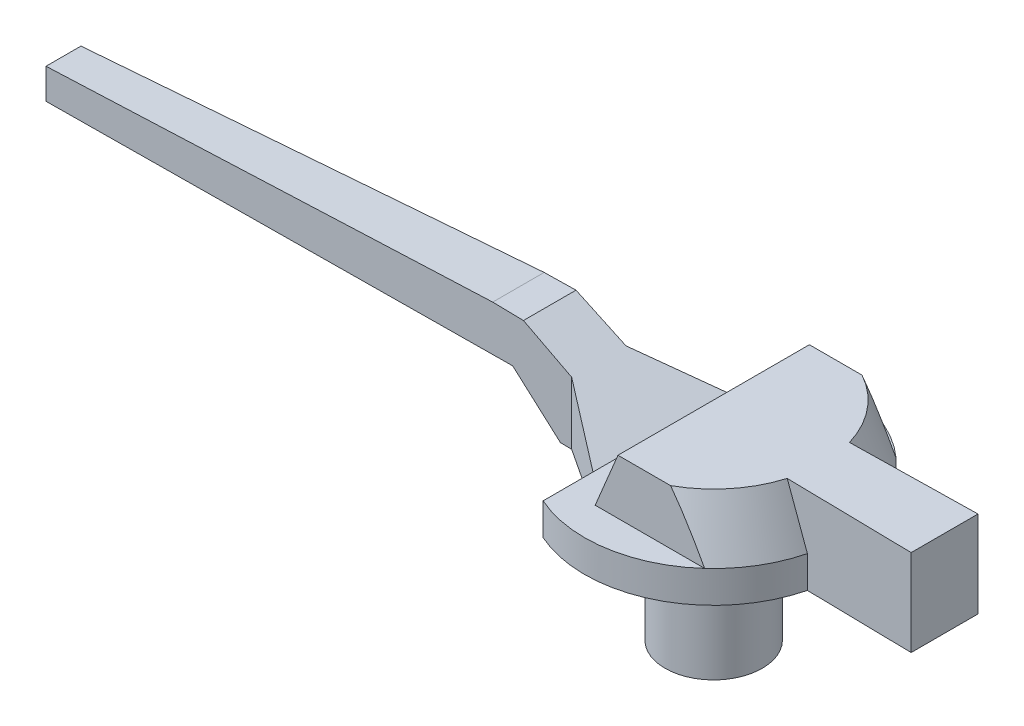
ISO-10303-21;
HEADER;
FILE_DESCRIPTION(('STEP AP214'),'2;1');
FILE_NAME('part.step','',(''),(''),'','','');
FILE_SCHEMA(('AUTOMOTIVE_DESIGN { 1 0 10303 214 1 1 1 1 }'));
ENDSEC;
DATA;
#1=APPLICATION_CONTEXT('core data for automotive mechanical design processes');
#2=APPLICATION_PROTOCOL_DEFINITION('international standard','automotive_design',2000,#1);
#3=PRODUCT_CONTEXT('',#1,'mechanical');
#4=PRODUCT('Part','Part','',(#3));
#5=PRODUCT_RELATED_PRODUCT_CATEGORY('part','',(#4));
#6=PRODUCT_DEFINITION_FORMATION('','',#4);
#7=PRODUCT_DEFINITION_CONTEXT('part definition',#1,'design');
#8=PRODUCT_DEFINITION('design','',#6,#7);
#9=PRODUCT_DEFINITION_SHAPE('','',#8);
#10=(LENGTH_UNIT() NAMED_UNIT(*) SI_UNIT(.MILLI.,.METRE.));
#11=(NAMED_UNIT(*) PLANE_ANGLE_UNIT() SI_UNIT($,.RADIAN.));
#12=(NAMED_UNIT(*) SI_UNIT($,.STERADIAN.) SOLID_ANGLE_UNIT());
#13=UNCERTAINTY_MEASURE_WITH_UNIT(LENGTH_MEASURE(1.E-05),#10,'distance_accuracy_value','');
#14=(GEOMETRIC_REPRESENTATION_CONTEXT(3) GLOBAL_UNCERTAINTY_ASSIGNED_CONTEXT((#13)) GLOBAL_UNIT_ASSIGNED_CONTEXT((#10,
#11,#12)) REPRESENTATION_CONTEXT('',''));
#15=CARTESIAN_POINT('',(0.,0.,0.));
#16=DIRECTION('',(0.,0.,1.));
#17=DIRECTION('',(1.,0.,0.));
#18=AXIS2_PLACEMENT_3D('',#15,#16,#17);
#19=CARTESIAN_POINT('',(0.,6.85,3.59485357832084));
#20=DIRECTION('',(0.,1.,0.));
#21=DIRECTION('',(0.,0.,1.));
#22=AXIS2_PLACEMENT_3D('',#19,#20,#21);
#23=PLANE('',#22);
#24=DIRECTION('',(0.,0.,1.));
#25=VECTOR('',#24,1.);
#26=CARTESIAN_POINT('',(0.,6.85,-4.25));
#27=LINE('',#26,#25);
#28=CARTESIAN_POINT('',(0.,6.85,-3.15));
#29=VERTEX_POINT('',#28);
#30=CARTESIAN_POINT('',(0.,6.85,3.15));
#31=VERTEX_POINT('',#30);
#32=EDGE_CURVE('E231',#29,#31,#27,.T.);
#33=ORIENTED_EDGE('',*,*,#32,.T.);
#34=DIRECTION('',(1.,0.,0.));
#35=VECTOR('',#34,1.);
#36=CARTESIAN_POINT('',(-22.7341210153043,6.85,3.15));
#37=LINE('',#36,#35);
#38=CARTESIAN_POINT('',(1.73218712891134,6.85,3.15));
#39=VERTEX_POINT('',#38);
#40=EDGE_CURVE('E258',#31,#39,#37,.T.);
#41=ORIENTED_EDGE('',*,*,#40,.T.);
#42=CARTESIAN_POINT('',(0.,6.85,0.));
#43=DIRECTION('',(0.,1.,0.));
#44=DIRECTION('',(0.,0.,1.));
#45=AXIS2_PLACEMENT_3D('',#42,#43,#44);
#46=CIRCLE('',#45,3.59485357832084);
#47=CARTESIAN_POINT('',(3.44568894200541,6.85,1.02479264463975));
#48=VERTEX_POINT('',#47);
#49=EDGE_CURVE('E346',#39,#48,#46,.T.);
#50=ORIENTED_EDGE('',*,*,#49,.T.);
#51=DIRECTION('',(0.999836172848061,0.,0.0181004824394906));
#52=VECTOR('',#51,1.);
#53=CARTESIAN_POINT('',(-21.4,6.85,0.575000000000003));
#54=LINE('',#53,#52);
#55=CARTESIAN_POINT('',(7.6,6.85,1.1));
#56=VERTEX_POINT('',#55);
#57=EDGE_CURVE('E435',#48,#56,#54,.T.);
#58=ORIENTED_EDGE('',*,*,#57,.T.);
#59=DIRECTION('',(0.,0.,-1.));
#60=VECTOR('',#59,1.);
#61=CARTESIAN_POINT('',(7.6,6.85,-1.1));
#62=LINE('',#61,#60);
#63=CARTESIAN_POINT('',(7.6,6.85,-1.1));
#64=VERTEX_POINT('',#63);
#65=EDGE_CURVE('E276',#56,#64,#62,.T.);
#66=ORIENTED_EDGE('',*,*,#65,.T.);
#67=DIRECTION('',(-0.999836172848061,0.,0.0181004824394909));
#68=VECTOR('',#67,1.);
#69=CARTESIAN_POINT('',(-21.4,6.85,-0.574999999999997));
#70=LINE('',#69,#68);
#71=CARTESIAN_POINT('',(3.44568894200541,6.85,-1.02479264463975));
#72=VERTEX_POINT('',#71);
#73=EDGE_CURVE('E358',#64,#72,#70,.T.);
#74=ORIENTED_EDGE('',*,*,#73,.T.);
#75=CARTESIAN_POINT('',(1.73218712891134,6.85,-3.15));
#76=VERTEX_POINT('',#75);
#77=EDGE_CURVE('E347',#72,#76,#46,.T.);
#78=ORIENTED_EDGE('',*,*,#77,.T.);
#79=DIRECTION('',(-1.,0.,0.));
#80=VECTOR('',#79,1.);
#81=CARTESIAN_POINT('',(-22.7341210153043,6.85,-3.15));
#82=LINE('',#81,#80);
#83=EDGE_CURVE('E253',#76,#29,#82,.T.);
#84=ORIENTED_EDGE('',*,*,#83,.T.);
#85=EDGE_LOOP('',(#33,#41,#50,#58,#66,#74,#78,#84));
#86=FACE_BOUND('',#85,.T.);
#87=ADVANCED_FACE('F35',(#86),#23,.T.);
#88=CARTESIAN_POINT('',(-22.7341210153043,5.05,-3.15));
#89=DIRECTION('',(0.,0.,-1.));
#90=DIRECTION('',(-1.,0.,0.));
#91=AXIS2_PLACEMENT_3D('',#88,#89,#90);
#92=PLANE('',#91);
#93=DIRECTION('',(-0.384309346161683,-0.92320437956759,0.));
#94=VECTOR('',#93,1.);
#95=CARTESIAN_POINT('',(-3.99631877629076,-2.75012821251461,-3.15));
#96=LINE('',#95,#94);
#97=CARTESIAN_POINT('',(-0.749299763303804,5.05,-3.15));
#98=VERTEX_POINT('',#97);
#99=EDGE_CURVE('E246',#29,#98,#96,.T.);
#100=ORIENTED_EDGE('',*,*,#99,.F.);
#101=ORIENTED_EDGE('',*,*,#83,.F.);
#102=CARTESIAN_POINT('',(5.22381936480329,-0.033010855341316,-3.15));
#103=CARTESIAN_POINT('',(5.14495567701918,0.152532557431077,-3.15));
#104=CARTESIAN_POINT('',(5.06569488382415,0.337907468383486,-3.15));
#105=CARTESIAN_POINT('',(4.90624962533424,0.708263200551652,-3.15));
#106=CARTESIAN_POINT('',(4.82606514450563,0.893244015077681,-3.15));
#107=CARTESIAN_POINT('',(4.5838649730113,1.44766284120869,-3.15));
#108=CARTESIAN_POINT('',(4.42027170529409,1.81641390338952,-3.15));
#109=CARTESIAN_POINT('',(4.08649805080444,2.55342080769807,-3.15));
#110=CARTESIAN_POINT('',(3.9162860135979,2.92166241651889,-3.15));
#111=CARTESIAN_POINT('',(3.65487510984843,3.47109020263562,-3.15));
#112=CARTESIAN_POINT('',(3.56673013433733,3.6537288583614,-3.15));
#113=CARTESIAN_POINT('',(3.38794802768471,4.017780370278,-3.15));
#114=CARTESIAN_POINT('',(3.2973109675942,4.19919326123285,-3.15));
#115=CARTESIAN_POINT('',(3.1429377038914,4.50168901154047,-3.15));
#116=CARTESIAN_POINT('',(3.08004165800818,4.62320048948627,-3.15));
#117=CARTESIAN_POINT('',(2.95260227884569,4.8653618981108,-3.15));
#118=CARTESIAN_POINT('',(2.8880589071674,4.98601180862241,-3.15));
#119=CARTESIAN_POINT('',(2.75713158951244,5.22606722716639,-3.15));
#120=CARTESIAN_POINT('',(2.69075067362047,5.34547438358233,-3.15));
#121=CARTESIAN_POINT('',(2.55567102168519,5.58296741215928,-3.15));
#122=CARTESIAN_POINT('',(2.48697236945122,5.70105333189103,-3.15));
#123=CARTESIAN_POINT('',(2.31496424942398,5.98874752581349,-3.15));
#124=CARTESIAN_POINT('',(2.21009154129165,6.15742725512448,-3.15));
#125=CARTESIAN_POINT('',(1.99196048385707,6.49004452262692,-3.15));
#126=CARTESIAN_POINT('',(1.87867998533311,6.65396782991419,-3.15));
#127=CARTESIAN_POINT('',(1.69739520071601,6.89681947482825,-3.15));
#128=CARTESIAN_POINT('',(1.63364150534616,6.97891035771082,-3.15));
#129=CARTESIAN_POINT('',(1.50212944766067,7.13992868366571,-3.15));
#130=CARTESIAN_POINT('',(1.43436884485295,7.21885431467363,-3.15));
#131=CARTESIAN_POINT('',(1.29419687235199,7.3719014141089,-3.15));
#132=CARTESIAN_POINT('',(1.22180613172348,7.44604158882279,-3.15));
#133=CARTESIAN_POINT('',(1.07095134448111,7.58778836033345,-3.15));
#134=CARTESIAN_POINT('',(0.992496222236826,7.65540424061663,-3.15));
#135=CARTESIAN_POINT('',(0.845782642582632,7.76729629194008,-3.15));
#136=CARTESIAN_POINT('',(0.778983405493767,7.81345883202385,-3.15));
#137=CARTESIAN_POINT('',(0.640117072602644,7.89729802373699,-3.15));
#138=CARTESIAN_POINT('',(0.568049216947703,7.93497344812378,-3.15));
#139=CARTESIAN_POINT('',(0.417549587897641,7.99893892729097,-3.15));
#140=CARTESIAN_POINT('',(0.33903796604973,8.02504791739727,-3.15));
#141=CARTESIAN_POINT('',(0.178432781640517,8.0611110724464,-3.15));
#142=CARTESIAN_POINT('',(0.096349961707025,8.07111065476694,-3.15));
#143=CARTESIAN_POINT('',(-0.0573582576975756,8.0730314333221,-3.15));
#144=CARTESIAN_POINT('',(-0.128961958287773,8.0671252034297,-3.15));
#145=CARTESIAN_POINT('',(-0.269995681888301,8.04265285116534,-3.15));
#146=CARTESIAN_POINT('',(-0.339422302947616,8.02406785640181,-3.15));
#147=CARTESIAN_POINT('',(-0.497035075839306,7.96859490489518,-3.15));
#148=CARTESIAN_POINT('',(-0.583769931304419,7.9276730256982,-3.15));
#149=CARTESIAN_POINT('',(-0.749963771207834,7.83314471384848,-3.15));
#150=CARTESIAN_POINT('',(-0.829403714269844,7.77950632468678,-3.15));
#151=CARTESIAN_POINT('',(-1.00180937817989,7.64863871243276,-3.15));
#152=CARTESIAN_POINT('',(-1.09284507954546,7.56891399257645,-3.15));
#153=CARTESIAN_POINT('',(-1.26696061828916,7.40110679303775,-3.15));
#154=CARTESIAN_POINT('',(-1.35002391421322,7.3130076602965,-3.15));
#155=CARTESIAN_POINT('',(-1.51044587634024,7.13080847705093,-3.15));
#156=CARTESIAN_POINT('',(-1.58776451023087,7.03667354255814,-3.15));
#157=CARTESIAN_POINT('',(-1.7000233279777,6.89269216163978,-3.15));
#158=CARTESIAN_POINT('',(-1.73680673483998,6.84425851733016,-3.15));
#159=CARTESIAN_POINT('',(-1.80928449234865,6.7465839411893,-3.15));
#160=CARTESIAN_POINT('',(-1.84497887400011,6.69734303240275,-3.15));
#161=CARTESIAN_POINT('',(-1.95702732044978,6.53956731775937,-3.15));
#162=CARTESIAN_POINT('',(-2.03156983116559,6.42974516138425,-3.15));
#163=CARTESIAN_POINT('',(-2.17703999359645,6.20772350136295,-3.15));
#164=CARTESIAN_POINT('',(-2.24796695394313,6.09552354879672,-3.15));
#165=CARTESIAN_POINT('',(-2.3869353428927,5.8692621596948,-3.15));
#166=CARTESIAN_POINT('',(-2.45497499342075,5.7551996343321,-3.15));
#167=CARTESIAN_POINT('',(-2.58864585682077,5.52566901348548,-3.15));
#168=CARTESIAN_POINT('',(-2.654276933036,5.41020083874185,-3.15));
#169=CARTESIAN_POINT('',(-2.8484884143847,5.06157369410575,-3.15));
#170=CARTESIAN_POINT('',(-2.97405784074283,4.82673804062048,-3.15));
#171=CARTESIAN_POINT('',(-3.21938233758963,4.35418241089293,-3.15));
#172=CARTESIAN_POINT('',(-3.33913941554113,4.11646346644813,-3.15));
#173=CARTESIAN_POINT('',(-3.57424196074227,3.63902282157942,-3.15));
#174=CARTESIAN_POINT('',(-3.68958982645136,3.39930229897353,-3.15));
#175=CARTESIAN_POINT('',(-3.91692895759912,2.91825595307042,-3.15));
#176=CARTESIAN_POINT('',(-4.02891994242668,2.67692999761955,-3.15));
#177=CARTESIAN_POINT('',(-4.25009536736851,2.19334151251332,-3.15));
#178=CARTESIAN_POINT('',(-4.35928295768747,1.95108042073242,-3.15));
#179=CARTESIAN_POINT('',(-4.57549427132912,1.4655943198773,-3.15));
#180=CARTESIAN_POINT('',(-4.68251798190039,1.22236930513293,-3.15));
#181=CARTESIAN_POINT('',(-4.86201325734104,0.810357735188615,-3.15));
#182=CARTESIAN_POINT('',(-4.93495074047685,0.641773760137068,-3.15));
#183=CARTESIAN_POINT('',(-5.07997424646209,0.304502444949109,-3.15));
#184=CARTESIAN_POINT('',(-5.1520612625646,0.135815532015534,-3.15));
#185=CARTESIAN_POINT('',(-5.22381936480328,-0.0330108553412743,-3.15));
#186=B_SPLINE_CURVE_WITH_KNOTS('',3,(#102,#103,#104,#105,#106,#107,#108,#109,#110,#111,#112,
#113,#114,#115,#116,#117,#118,#119,#120,#121,#122,#123,#124,#125,#126,#127,#128,#129,#130,#131,
#132,#133,#134,#135,#136,#137,#138,#139,#140,#141,#142,#143,#144,#145,#146,#147,#148,#149,#150,
#151,#152,#153,#154,#155,#156,#157,#158,#159,#160,#161,#162,#163,#164,#165,#166,#167,#168,#169,
#170,#171,#172,#173,#174,#175,#176,#177,#178,#179,#180,#181,#182,#183,#184,#185),.UNSPECIFIED.,
.F.,.F.,(4,2,2,2,2,2,2,2,2,2,2,2,2,2,2,2,2,2,2,2,2,2,2,2,2,2,2,2,2,2,2,2,2,2,2,2,2,2,2,2,2,4),
(0.,0.604824078991897,1.20965834425946,2.41985894937507,3.63680942797234,4.24518504260662,
4.853543329996,5.26400675512837,5.67447975688177,6.08431207580081,6.49412959103372,
7.08985917728869,7.68721800500044,7.99894607798248,8.31085013520199,8.62145013940463,
8.93160146064252,9.17474311369956,9.41791990266579,9.66477944104606,9.91094178069716,
10.1252401088006,10.3398581188116,10.6259405795314,10.9127497299377,11.2749136910383,
11.6378135366774,12.0030423964253,12.185486164173,12.3679247328035,12.7660132931915,
13.1641776930089,13.5625838354414,13.9610125476453,14.7597813768309,15.5582723357298,
16.3563225759812,17.1544393424966,17.9516160834208,18.7487975206206,19.2998528727287,
19.8501838308644),.UNSPECIFIED.);
#187=CARTESIAN_POINT('',(2.85306852353742,5.05,-3.15));
#188=VERTEX_POINT('',#187);
#189=EDGE_CURVE('E298',#188,#76,#186,.T.);
#190=ORIENTED_EDGE('',*,*,#189,.F.);
#191=DIRECTION('',(-1.,0.,0.));
#192=VECTOR('',#191,1.);
#193=CARTESIAN_POINT('',(-22.7341210153043,5.05,-3.15));
#194=LINE('',#193,#192);
#195=EDGE_CURVE('E254',#188,#98,#194,.T.);
#196=ORIENTED_EDGE('',*,*,#195,.T.);
#197=EDGE_LOOP('',(#100,#101,#190,#196));
#198=FACE_BOUND('',#197,.T.);
#199=ADVANCED_FACE('F287',(#198),#92,.T.);
#200=CARTESIAN_POINT('',(-22.7341210153043,5.05,3.15));
#201=DIRECTION('',(0.,0.,1.));
#202=DIRECTION('',(1.,0.,0.));
#203=AXIS2_PLACEMENT_3D('',#200,#201,#202);
#204=PLANE('',#203);
#205=DIRECTION('',(0.384309346161683,0.92320437956759,0.));
#206=VECTOR('',#205,1.);
#207=CARTESIAN_POINT('',(0.,6.85,3.15));
#208=LINE('',#207,#206);
#209=CARTESIAN_POINT('',(-0.749299763303804,5.05,3.15));
#210=VERTEX_POINT('',#209);
#211=EDGE_CURVE('E221',#210,#31,#208,.T.);
#212=ORIENTED_EDGE('',*,*,#211,.F.);
#213=DIRECTION('',(1.,0.,0.));
#214=VECTOR('',#213,1.);
#215=CARTESIAN_POINT('',(-22.7341210153043,5.05,3.15));
#216=LINE('',#215,#214);
#217=CARTESIAN_POINT('',(2.85306852353742,5.05,3.15));
#218=VERTEX_POINT('',#217);
#219=EDGE_CURVE('E257',#210,#218,#216,.T.);
#220=ORIENTED_EDGE('',*,*,#219,.T.);
#221=CARTESIAN_POINT('',(-5.22381936480328,-0.0330108553412764,3.15));
#222=CARTESIAN_POINT('',(-5.14495567701917,0.152532557431112,3.15));
#223=CARTESIAN_POINT('',(-5.06569488382413,0.337907468383516,3.15));
#224=CARTESIAN_POINT('',(-4.90624962533424,0.708263200551674,3.15));
#225=CARTESIAN_POINT('',(-4.82606514450563,0.893244015077698,3.15));
#226=CARTESIAN_POINT('',(-4.5838649730113,1.4476628412087,3.15));
#227=CARTESIAN_POINT('',(-4.42027170529409,1.81641390338952,3.15));
#228=CARTESIAN_POINT('',(-4.08649805080445,2.55342080769805,3.15));
#229=CARTESIAN_POINT('',(-3.91628601359791,2.92166241651887,3.15));
#230=CARTESIAN_POINT('',(-3.65487510984845,3.47109020263559,3.15));
#231=CARTESIAN_POINT('',(-3.56673013433734,3.65372885836137,3.15));
#232=CARTESIAN_POINT('',(-3.38794802768473,4.01778037027795,3.15));
#233=CARTESIAN_POINT('',(-3.29731096759422,4.19919326123281,3.15));
#234=CARTESIAN_POINT('',(-3.14293770389142,4.50168901154044,3.15));
#235=CARTESIAN_POINT('',(-3.0800416580082,4.62320048948625,3.15));
#236=CARTESIAN_POINT('',(-2.95260227884569,4.8653618981108,3.15));
#237=CARTESIAN_POINT('',(-2.88805890716739,4.98601180862242,3.15));
#238=CARTESIAN_POINT('',(-2.75713158951242,5.22606722716642,3.15));
#239=CARTESIAN_POINT('',(-2.69075067362045,5.34547438358238,3.15));
#240=CARTESIAN_POINT('',(-2.55567102168515,5.58296741215935,3.15));
#241=CARTESIAN_POINT('',(-2.48697236945117,5.70105333189111,3.15));
#242=CARTESIAN_POINT('',(-2.3149642494239,5.98874752581363,3.15));
#243=CARTESIAN_POINT('',(-2.21009154129155,6.15742725512465,3.15));
#244=CARTESIAN_POINT('',(-1.99196048385691,6.49004452262715,3.15));
#245=CARTESIAN_POINT('',(-1.87867998533293,6.65396782991446,3.15));
#246=CARTESIAN_POINT('',(-1.69739520071578,6.89681947482855,3.15));
#247=CARTESIAN_POINT('',(-1.63364150534592,6.97891035771113,3.15));
#248=CARTESIAN_POINT('',(-1.50212944766039,7.13992868366604,3.15));
#249=CARTESIAN_POINT('',(-1.43436884485265,7.21885431467397,3.15));
#250=CARTESIAN_POINT('',(-1.29419687235166,7.37190141410925,3.15));
#251=CARTESIAN_POINT('',(-1.22180613172312,7.44604158882314,3.15));
#252=CARTESIAN_POINT('',(-1.07095134448071,7.58778836033381,3.15));
#253=CARTESIAN_POINT('',(-0.992496222236406,7.65540424061699,3.15));
#254=CARTESIAN_POINT('',(-0.845782642582188,7.76729629194039,3.15));
#255=CARTESIAN_POINT('',(-0.778983405493326,7.81345883202414,3.15));
#256=CARTESIAN_POINT('',(-0.64011707260221,7.89729802373723,3.15));
#257=CARTESIAN_POINT('',(-0.568049216947274,7.93497344812399,3.15));
#258=CARTESIAN_POINT('',(-0.417549587897225,7.99893892729112,3.15));
#259=CARTESIAN_POINT('',(-0.339037966049323,8.02504791739739,3.15));
#260=CARTESIAN_POINT('',(-0.178432781640133,8.06111107244646,3.15));
#261=CARTESIAN_POINT('',(-0.0963499617066552,8.07111065476697,3.15));
#262=CARTESIAN_POINT('',(0.0573582576979104,8.07303143332208,3.15));
#263=CARTESIAN_POINT('',(0.128961958288088,8.06712520342966,3.15));
#264=CARTESIAN_POINT('',(0.269995681888574,8.04265285116527,3.15));
#265=CARTESIAN_POINT('',(0.339422302947869,8.02406785640174,3.15));
#266=CARTESIAN_POINT('',(0.497035075839557,7.96859490489508,3.15));
#267=CARTESIAN_POINT('',(0.583769931304686,7.92767302569807,3.15));
#268=CARTESIAN_POINT('',(0.74996377120813,7.8331447138483,3.15));
#269=CARTESIAN_POINT('',(0.829403714270153,7.77950632468657,3.15));
#270=CARTESIAN_POINT('',(1.00180937818026,7.64863871243246,3.15));
#271=CARTESIAN_POINT('',(1.09284507954587,7.56891399257609,3.15));
#272=CARTESIAN_POINT('',(1.26696061828965,7.40110679303725,3.15));
#273=CARTESIAN_POINT('',(1.35002391421374,7.31300766029594,3.15));
#274=CARTESIAN_POINT('',(1.51044587634083,7.13080847705023,3.15));
#275=CARTESIAN_POINT('',(1.58776451023149,7.03667354255738,3.15));
#276=CARTESIAN_POINT('',(1.70002332797836,6.89269216163892,3.15));
#277=CARTESIAN_POINT('',(1.73680673484066,6.84425851732926,3.15));
#278=CARTESIAN_POINT('',(1.80928449234936,6.74658394118834,3.15));
#279=CARTESIAN_POINT('',(1.84497887400084,6.69734303240175,3.15));
#280=CARTESIAN_POINT('',(1.95702732045056,6.53956731775825,3.15));
#281=CARTESIAN_POINT('',(2.0315698311664,6.42974516138305,3.15));
#282=CARTESIAN_POINT('',(2.17703999359733,6.20772350136158,3.15));
#283=CARTESIAN_POINT('',(2.24796695394404,6.09552354879527,3.15));
#284=CARTESIAN_POINT('',(2.38693534289367,5.86926215969319,3.15));
#285=CARTESIAN_POINT('',(2.45497499342176,5.7551996343304,3.15));
#286=CARTESIAN_POINT('',(2.58864585682184,5.52566901348362,3.15));
#287=CARTESIAN_POINT('',(2.6542769330371,5.41020083873991,3.15));
#288=CARTESIAN_POINT('',(2.8484884143859,5.06157369410355,3.15));
#289=CARTESIAN_POINT('',(2.97405784074408,4.82673804061811,3.15));
#290=CARTESIAN_POINT('',(3.219382337591,4.35418241089023,3.15));
#291=CARTESIAN_POINT('',(3.33913941554257,4.11646346644527,3.15));
#292=CARTESIAN_POINT('',(3.57424196074382,3.63902282157623,3.15));
#293=CARTESIAN_POINT('',(3.68958982645297,3.39930229897017,3.15));
#294=CARTESIAN_POINT('',(3.91692895760085,2.91825595306672,3.15));
#295=CARTESIAN_POINT('',(4.02891994242847,2.67692999761569,3.15));
#296=CARTESIAN_POINT('',(4.25009536737041,2.19334151250913,3.15));
#297=CARTESIAN_POINT('',(4.35928295768942,1.95108042072806,3.15));
#298=CARTESIAN_POINT('',(4.57549427133119,1.46559431987262,3.15));
#299=CARTESIAN_POINT('',(4.68251798190251,1.22236930512808,3.15));
#300=CARTESIAN_POINT('',(4.86201325734285,0.810357735184436,3.15));
#301=CARTESIAN_POINT('',(4.93495074047829,0.641773760133724,3.15));
#302=CARTESIAN_POINT('',(5.0799742464628,0.304502444947436,3.15));
#303=CARTESIAN_POINT('',(5.15206126256496,0.135815532014697,3.15));
#304=CARTESIAN_POINT('',(5.22381936480328,-0.0330108553412743,3.15));
#305=B_SPLINE_CURVE_WITH_KNOTS('',3,(#221,#222,#223,#224,#225,#226,#227,#228,#229,#230,#231,
#232,#233,#234,#235,#236,#237,#238,#239,#240,#241,#242,#243,#244,#245,#246,#247,#248,#249,#250,
#251,#252,#253,#254,#255,#256,#257,#258,#259,#260,#261,#262,#263,#264,#265,#266,#267,#268,#269,
#270,#271,#272,#273,#274,#275,#276,#277,#278,#279,#280,#281,#282,#283,#284,#285,#286,#287,#288,
#289,#290,#291,#292,#293,#294,#295,#296,#297,#298,#299,#300,#301,#302,#303,#304),.UNSPECIFIED.,
.F.,.F.,(4,2,2,2,2,2,2,2,2,2,2,2,2,2,2,2,2,2,2,2,2,2,2,2,2,2,2,2,2,2,2,2,2,2,2,2,2,2,2,2,2,4),
(0.,0.604824078991882,1.20965834425944,2.41985894937501,3.63680942797226,4.24518504260653,
4.8535433299959,5.26400675512831,5.67447975688176,6.08431207580083,6.49412959103379,
7.08985917728889,7.68721800500077,7.99894607798285,8.31085013520241,8.6214501394051,
8.93160146064304,9.17474311370003,9.41791990266621,9.66477944104643,9.91094178069747,
10.1252401088008,10.3398581188118,10.6259405795317,10.912749729938,11.2749136910389,
11.6378135366782,12.0030423964263,12.1854861641741,12.3679247328047,12.766013293193,
13.1641776930106,13.5625838354434,13.9610125476476,14.7597813768337,15.5582723357331,
16.3563225759851,17.154439342501,17.9516160834257,18.748797520626,19.2998528727314,
19.8501838308643),.UNSPECIFIED.);
#306=EDGE_CURVE('E266',#39,#218,#305,.T.);
#307=ORIENTED_EDGE('',*,*,#306,.F.);
#308=ORIENTED_EDGE('',*,*,#40,.F.);
#309=EDGE_LOOP('',(#212,#220,#307,#308));
#310=FACE_BOUND('',#309,.T.);
#311=ADVANCED_FACE('F282',(#310),#204,.T.);
#312=CARTESIAN_POINT('',(0.,6.85,0.));
#313=DIRECTION('',(0.,-1.,0.));
#314=DIRECTION('',(0.,0.,-1.));
#315=AXIS2_PLACEMENT_3D('',#312,#313,#314);
#316=CONICAL_SURFACE('',#315,3.59485357832084,0.349065850398867);
#317=ORIENTED_EDGE('',*,*,#49,.F.);
#318=ORIENTED_EDGE('',*,*,#306,.T.);
#319=CARTESIAN_POINT('',(0.,5.05,0.));
#320=DIRECTION('',(0.,1.,0.));
#321=DIRECTION('',(0.,0.,1.));
#322=AXIS2_PLACEMENT_3D('',#319,#320,#321);
#323=CIRCLE('',#322,4.25);
#324=CARTESIAN_POINT('',(4.12153773035656,5.05,1.03702783822197));
#325=VERTEX_POINT('',#324);
#326=EDGE_CURVE('E337',#218,#325,#323,.T.);
#327=ORIENTED_EDGE('',*,*,#326,.T.);
#328=CARTESIAN_POINT('',(3.44561340334413,6.8502,1.02479127712951));
#329=CARTESIAN_POINT('',(3.50223789065833,6.70027618538404,1.02581637560675));
#330=CARTESIAN_POINT('',(3.55877666425058,6.5503200126149,1.02683992237005));
#331=CARTESIAN_POINT('',(3.67170269520835,6.25035074021333,1.0288842729305));
#332=CARTESIAN_POINT('',(3.72808995269352,6.10033764062596,1.0299050767298));
#333=CARTESIAN_POINT('',(3.8407329417131,5.80026209468498,1.03194430325515));
#334=CARTESIAN_POINT('',(3.89698867327166,5.65019964834043,1.03296272598164));
#335=CARTESIAN_POINT('',(4.00938392143666,5.35003108854809,1.03499746754325));
#336=CARTESIAN_POINT('',(4.06552343795139,5.19992497506594,1.03601378637671));
#337=CARTESIAN_POINT('',(4.12161245288775,5.0498,1.03702919095745));
#338=B_SPLINE_CURVE_WITH_KNOTS('',3,(#328,#329,#330,#331,#332,#333,#334,#335,#336,#337),
.UNSPECIFIED.,.F.,.F.,(4,2,2,2,4),(0.,0.480791788615058,0.961583197440473,1.44237451802931,
1.92316621792615),.UNSPECIFIED.);
#339=EDGE_CURVE('E371',#48,#325,#338,.T.);
#340=ORIENTED_EDGE('',*,*,#339,.F.);
#341=EDGE_LOOP('',(#317,#318,#327,#340));
#342=FACE_BOUND('',#341,.T.);
#343=ADVANCED_FACE('F278',(#342),#316,.T.);
#344=DIRECTION('',(0.,0.,1.));
#345=VECTOR('',#344,1.);
#346=CARTESIAN_POINT('',(-6.42505679996219,6.85,-4.25));
#347=LINE('',#346,#345);
#348=CARTESIAN_POINT('',(-6.42505679996227,6.85,-0.846098109655855));
#349=VERTEX_POINT('',#348);
#350=CARTESIAN_POINT('',(-6.42505679996219,6.85,0.846098109655858));
#351=VERTEX_POINT('',#350);
#352=EDGE_CURVE('E58',#349,#351,#347,.T.);
#353=ORIENTED_EDGE('',*,*,#352,.T.);
#354=CARTESIAN_POINT('',(-5.39528557591116,6.85,0.864740519746437));
#355=VERTEX_POINT('',#354);
#356=EDGE_CURVE('E430',#351,#355,#54,.T.);
#357=ORIENTED_EDGE('',*,*,#356,.T.);
#358=DIRECTION('',(0.,0.,1.));
#359=VECTOR('',#358,1.);
#360=CARTESIAN_POINT('',(-5.39528557591117,6.85,-4.25));
#361=LINE('',#360,#359);
#362=CARTESIAN_POINT('',(-5.39528557591116,6.85,-0.864740519746435));
#363=VERTEX_POINT('',#362);
#364=EDGE_CURVE('E230',#363,#355,#361,.T.);
#365=ORIENTED_EDGE('',*,*,#364,.F.);
#366=EDGE_CURVE('E275',#363,#349,#70,.T.);
#367=ORIENTED_EDGE('',*,*,#366,.T.);
#368=EDGE_LOOP('',(#353,#357,#365,#367));
#369=FACE_BOUND('',#368,.T.);
#370=ADVANCED_FACE('F416',(#369),#23,.T.);
#371=CARTESIAN_POINT('',(4.12153773035656,5.05,-1.03702783822197));
#372=VERTEX_POINT('',#371);
#373=EDGE_CURVE('E341',#372,#188,#323,.T.);
#374=ORIENTED_EDGE('',*,*,#373,.T.);
#375=ORIENTED_EDGE('',*,*,#189,.T.);
#376=ORIENTED_EDGE('',*,*,#77,.F.);
#377=CARTESIAN_POINT('',(4.12161245288775,5.0498,-1.03702919095745));
#378=CARTESIAN_POINT('',(4.06552343795139,5.19992497506594,-1.03601378637671));
#379=CARTESIAN_POINT('',(4.00938392143666,5.35003108854809,-1.03499746754325));
#380=CARTESIAN_POINT('',(3.89698867327166,5.65019964834043,-1.03296272598164));
#381=CARTESIAN_POINT('',(3.8407329417131,5.80026209468498,-1.03194430325515));
#382=CARTESIAN_POINT('',(3.72808995269352,6.10033764062596,-1.0299050767298));
#383=CARTESIAN_POINT('',(3.67170269520835,6.25035074021333,-1.0288842729305));
#384=CARTESIAN_POINT('',(3.55877666425058,6.5503200126149,-1.02683992237005));
#385=CARTESIAN_POINT('',(3.50223789065833,6.70027618538403,-1.02581637560675));
#386=CARTESIAN_POINT('',(3.44561340334413,6.8502,-1.02479127712951));
#387=B_SPLINE_CURVE_WITH_KNOTS('',3,(#377,#378,#379,#380,#381,#382,#383,#384,#385,#386),
.UNSPECIFIED.,.F.,.F.,(4,2,2,2,4),(0.,0.48079169989684,0.961583020485681,1.4423744293111,
1.92316621792615),.UNSPECIFIED.);
#388=EDGE_CURVE('E363',#372,#72,#387,.T.);
#389=ORIENTED_EDGE('',*,*,#388,.F.);
#390=EDGE_LOOP('',(#374,#375,#376,#389));
#391=FACE_BOUND('',#390,.T.);
#392=ADVANCED_FACE('F362',(#391),#316,.T.);
#393=CARTESIAN_POINT('',(0.,0.,0.));
#394=DIRECTION('',(0.,1.,0.));
#395=DIRECTION('',(0.,0.,1.));
#396=AXIS2_PLACEMENT_3D('',#393,#394,#395);
#397=CYLINDRICAL_SURFACE('',#396,4.25);
#398=DIRECTION('',(0.,1.,0.));
#399=VECTOR('',#398,1.);
#400=CARTESIAN_POINT('',(-1.73218712891134,0.,3.88098283305065));
#401=LINE('',#400,#399);
#402=CARTESIAN_POINT('',(-1.73218712891134,4.,3.88098283305065));
#403=VERTEX_POINT('',#402);
#404=CARTESIAN_POINT('',(-1.73218712891134,5.05,3.88098283305065));
#405=VERTEX_POINT('',#404);
#406=EDGE_CURVE('E212',#403,#405,#401,.T.);
#407=ORIENTED_EDGE('',*,*,#406,.F.);
#408=CARTESIAN_POINT('',(0.,4.,0.));
#409=DIRECTION('',(0.,1.,0.));
#410=DIRECTION('',(0.,0.,1.));
#411=AXIS2_PLACEMENT_3D('',#408,#409,#410);
#412=CIRCLE('',#411,4.25);
#413=CARTESIAN_POINT('',(4.12153773035656,4.,1.03702783822197));
#414=VERTEX_POINT('',#413);
#415=EDGE_CURVE('E338',#403,#414,#412,.T.);
#416=ORIENTED_EDGE('',*,*,#415,.T.);
#417=DIRECTION('',(0.,1.,0.));
#418=VECTOR('',#417,1.);
#419=CARTESIAN_POINT('',(4.12153773035656,0.,1.03702783822197));
#420=LINE('',#419,#418);
#421=EDGE_CURVE('E368',#325,#414,#420,.F.);
#422=ORIENTED_EDGE('',*,*,#421,.F.);
#423=ORIENTED_EDGE('',*,*,#326,.F.);
#424=CARTESIAN_POINT('',(0.,5.05,0.));
#425=DIRECTION('',(0.,1.,0.));
#426=DIRECTION('',(0.,0.,1.));
#427=AXIS2_PLACEMENT_3D('',#424,#425,#426);
#428=CIRCLE('',#427,4.25);
#429=EDGE_CURVE('E260',#218,#405,#428,.F.);
#430=ORIENTED_EDGE('',*,*,#429,.T.);
#431=EDGE_LOOP('',(#407,#416,#422,#423,#430));
#432=FACE_BOUND('',#431,.T.);
#433=ADVANCED_FACE('F414',(#432),#397,.T.);
#434=CARTESIAN_POINT('',(0.,0.,0.));
#435=DIRECTION('',(0.,1.,0.));
#436=DIRECTION('',(0.,0.,1.));
#437=AXIS2_PLACEMENT_3D('',#434,#435,#436);
#438=CYLINDRICAL_SURFACE('',#437,1.6);
#439=CARTESIAN_POINT('',(0.,0.,0.));
#440=DIRECTION('',(0.,1.,0.));
#441=DIRECTION('',(0.,0.,1.));
#442=AXIS2_PLACEMENT_3D('',#439,#440,#441);
#443=CIRCLE('',#442,1.6);
#444=CARTESIAN_POINT('',(0.,0.,1.6));
#445=VERTEX_POINT('',#444);
#446=EDGE_CURVE('E308',#445,#445,#443,.T.);
#447=ORIENTED_EDGE('',*,*,#446,.T.);
#448=EDGE_LOOP('',(#447));
#449=FACE_BOUND('',#448,.T.);
#450=CARTESIAN_POINT('',(0.,4.,0.));
#451=DIRECTION('',(0.,1.,0.));
#452=DIRECTION('',(0.,0.,1.));
#453=AXIS2_PLACEMENT_3D('',#450,#451,#452);
#454=CIRCLE('',#453,1.6);
#455=CARTESIAN_POINT('',(0.,4.,1.6));
#456=VERTEX_POINT('',#455);
#457=EDGE_CURVE('E342',#456,#456,#454,.T.);
#458=ORIENTED_EDGE('',*,*,#457,.F.);
#459=EDGE_LOOP('',(#458));
#460=FACE_BOUND('',#459,.T.);
#461=ADVANCED_FACE('F37',(#449,#460),#438,.T.);
#462=CARTESIAN_POINT('',(0.,0.,0.45));
#463=DIRECTION('',(0.,-1.,0.));
#464=DIRECTION('',(0.,0.,-1.));
#465=AXIS2_PLACEMENT_3D('',#462,#463,#464);
#466=PLANE('',#465);
#467=CARTESIAN_POINT('',(0.,0.,0.));
#468=DIRECTION('',(0.,1.,0.));
#469=DIRECTION('',(0.,0.,1.));
#470=AXIS2_PLACEMENT_3D('',#467,#468,#469);
#471=CIRCLE('',#470,0.45);
#472=CARTESIAN_POINT('',(0.,0.,0.45));
#473=VERTEX_POINT('',#472);
#474=EDGE_CURVE('E348',#473,#473,#471,.T.);
#475=ORIENTED_EDGE('',*,*,#474,.T.);
#476=EDGE_LOOP('',(#475));
#477=FACE_BOUND('',#476,.T.);
#478=ORIENTED_EDGE('',*,*,#446,.F.);
#479=EDGE_LOOP('',(#478));
#480=FACE_BOUND('',#479,.T.);
#481=ADVANCED_FACE('F408',(#477,#480),#466,.T.);
#482=CARTESIAN_POINT('',(0.,0.,0.));
#483=DIRECTION('',(0.,1.,0.));
#484=DIRECTION('',(0.,0.,1.));
#485=AXIS2_PLACEMENT_3D('',#482,#483,#484);
#486=CYLINDRICAL_SURFACE('',#485,0.45);
#487=CARTESIAN_POINT('',(0.,4.,0.));
#488=DIRECTION('',(0.,-1.,0.));
#489=DIRECTION('',(0.,0.,-1.));
#490=AXIS2_PLACEMENT_3D('',#487,#488,#489);
#491=CIRCLE('',#490,0.45);
#492=CARTESIAN_POINT('',(0.,4.,-0.45));
#493=VERTEX_POINT('',#492);
#494=EDGE_CURVE('E307',#493,#493,#491,.T.);
#495=ORIENTED_EDGE('',*,*,#494,.F.);
#496=EDGE_LOOP('',(#495));
#497=FACE_BOUND('',#496,.T.);
#498=ORIENTED_EDGE('',*,*,#474,.F.);
#499=EDGE_LOOP('',(#498));
#500=FACE_BOUND('',#499,.T.);
#501=ADVANCED_FACE('F405',(#497,#500),#486,.F.);
#502=DIRECTION('',(0.,1.,0.));
#503=VECTOR('',#502,1.);
#504=CARTESIAN_POINT('',(-1.73218712891134,0.,-3.88098283305065));
#505=LINE('',#504,#503);
#506=CARTESIAN_POINT('',(-1.73218712891134,5.05,-3.88098283305065));
#507=VERTEX_POINT('',#506);
#508=CARTESIAN_POINT('',(-1.73218712891134,4.,-3.88098283305065));
#509=VERTEX_POINT('',#508);
#510=EDGE_CURVE('E210',#507,#509,#505,.F.);
#511=ORIENTED_EDGE('',*,*,#510,.F.);
#512=EDGE_CURVE('E322',#188,#507,#323,.T.);
#513=ORIENTED_EDGE('',*,*,#512,.F.);
#514=ORIENTED_EDGE('',*,*,#373,.F.);
#515=DIRECTION('',(0.,1.,0.));
#516=VECTOR('',#515,1.);
#517=CARTESIAN_POINT('',(4.12153773035656,0.,-1.03702783822197));
#518=LINE('',#517,#516);
#519=CARTESIAN_POINT('',(4.12153773035656,4.,-1.03702783822197));
#520=VERTEX_POINT('',#519);
#521=EDGE_CURVE('E335',#520,#372,#518,.T.);
#522=ORIENTED_EDGE('',*,*,#521,.F.);
#523=EDGE_CURVE('E333',#520,#509,#412,.T.);
#524=ORIENTED_EDGE('',*,*,#523,.T.);
#525=EDGE_LOOP('',(#511,#513,#514,#522,#524));
#526=FACE_BOUND('',#525,.T.);
#527=ADVANCED_FACE('F330',(#526),#397,.T.);
#528=CARTESIAN_POINT('',(0.,4.,1.6));
#529=DIRECTION('',(0.,-1.,0.));
#530=DIRECTION('',(0.,0.,-1.));
#531=AXIS2_PLACEMENT_3D('',#528,#529,#530);
#532=PLANE('',#531);
#533=DIRECTION('',(0.,0.,1.));
#534=VECTOR('',#533,1.);
#535=CARTESIAN_POINT('',(-1.73218712891134,4.,1.6));
#536=LINE('',#535,#534);
#537=CARTESIAN_POINT('',(-1.73218712891134,4.,-2.23974472030947));
#538=VERTEX_POINT('',#537);
#539=EDGE_CURVE('E217',#509,#538,#536,.T.);
#540=ORIENTED_EDGE('',*,*,#539,.F.);
#541=ORIENTED_EDGE('',*,*,#523,.F.);
#542=DIRECTION('',(-0.999836172848061,0.,0.0181004824394909));
#543=VECTOR('',#542,1.);
#544=CARTESIAN_POINT('',(-21.4,4.,-0.574999999999997));
#545=LINE('',#544,#543);
#546=CARTESIAN_POINT('',(7.6,4.,-1.1));
#547=VERTEX_POINT('',#546);
#548=EDGE_CURVE('E439',#547,#520,#545,.T.);
#549=ORIENTED_EDGE('',*,*,#548,.F.);
#550=DIRECTION('',(0.,0.,-1.));
#551=VECTOR('',#550,1.);
#552=CARTESIAN_POINT('',(7.6,4.,-1.1));
#553=LINE('',#552,#551);
#554=CARTESIAN_POINT('',(7.6,4.,1.1));
#555=VERTEX_POINT('',#554);
#556=EDGE_CURVE('E442',#555,#547,#553,.T.);
#557=ORIENTED_EDGE('',*,*,#556,.F.);
#558=DIRECTION('',(0.999836172848061,0.,0.0181004824394906));
#559=VECTOR('',#558,1.);
#560=CARTESIAN_POINT('',(-21.4,4.,0.575000000000003));
#561=LINE('',#560,#559);
#562=EDGE_CURVE('E446',#414,#555,#561,.T.);
#563=ORIENTED_EDGE('',*,*,#562,.F.);
#564=ORIENTED_EDGE('',*,*,#415,.F.);
#565=DIRECTION('',(0.,0.,1.));
#566=VECTOR('',#565,1.);
#567=CARTESIAN_POINT('',(-1.73218712891134,4.,1.6));
#568=LINE('',#567,#566);
#569=CARTESIAN_POINT('',(-1.73218712891134,4.,2.23974472030947));
#570=VERTEX_POINT('',#569);
#571=EDGE_CURVE('E207',#570,#403,#568,.T.);
#572=ORIENTED_EDGE('',*,*,#571,.F.);
#573=DIRECTION('',(0.835639778182339,0.,0.549277854204383));
#574=VECTOR('',#573,1.);
#575=CARTESIAN_POINT('',(-0.816253347547138,4.,2.84180095932118));
#576=LINE('',#575,#574);
#577=CARTESIAN_POINT('',(-3.77953939428761,4.,0.893991097172378));
#578=VERTEX_POINT('',#577);
#579=EDGE_CURVE('E196',#578,#570,#576,.T.);
#580=ORIENTED_EDGE('',*,*,#579,.F.);
#581=DIRECTION('',(0.999836172848061,0.,0.018100482439491));
#582=VECTOR('',#581,1.);
#583=CARTESIAN_POINT('',(0.0115387272750238,4.,0.962622683855841));
#584=LINE('',#583,#582);
#585=CARTESIAN_POINT('',(-4.15637233049132,4.,0.887169121603172));
#586=VERTEX_POINT('',#585);
#587=EDGE_CURVE('E178',#586,#578,#584,.T.);
#588=ORIENTED_EDGE('',*,*,#587,.F.);
#589=DIRECTION('',(0.,0.,1.));
#590=VECTOR('',#589,1.);
#591=CARTESIAN_POINT('',(-4.15637233049132,4.,-4.25));
#592=LINE('',#591,#590);
#593=CARTESIAN_POINT('',(-4.15637233049132,4.,-0.887169121603174));
#594=VERTEX_POINT('',#593);
#595=EDGE_CURVE('E219',#594,#586,#592,.T.);
#596=ORIENTED_EDGE('',*,*,#595,.F.);
#597=DIRECTION('',(-0.999836172848061,0.,0.018100482439491));
#598=VECTOR('',#597,1.);
#599=CARTESIAN_POINT('',(-0.0463733274097899,4.,-0.961574275969306));
#600=LINE('',#599,#598);
#601=CARTESIAN_POINT('',(-3.77953939428761,4.,-0.893991097172379));
#602=VERTEX_POINT('',#601);
#603=EDGE_CURVE('E190',#602,#594,#600,.T.);
#604=ORIENTED_EDGE('',*,*,#603,.F.);
#605=DIRECTION('',(-0.835639778182339,0.,0.549277854204383));
#606=VECTOR('',#605,1.);
#607=CARTESIAN_POINT('',(-2.28504830514017,4.,-1.87634124373919));
#608=LINE('',#607,#606);
#609=EDGE_CURVE('E208',#538,#602,#608,.T.);
#610=ORIENTED_EDGE('',*,*,#609,.F.);
#611=EDGE_LOOP('',(#540,#541,#549,#557,#563,#564,#572,#580,#588,#596,#604,#610));
#612=FACE_BOUND('',#611,.T.);
#613=ORIENTED_EDGE('',*,*,#457,.T.);
#614=EDGE_LOOP('',(#613));
#615=FACE_BOUND('',#614,.T.);
#616=ADVANCED_FACE('F204',(#612,#615),#532,.T.);
#617=CARTESIAN_POINT('',(7.6,-25.0833285577838,-1.1));
#618=DIRECTION('',(1.,0.,0.));
#619=DIRECTION('',(0.,0.,-1.));
#620=AXIS2_PLACEMENT_3D('',#617,#618,#619);
#621=PLANE('',#620);
#622=DIRECTION('',(0.,1.,0.));
#623=VECTOR('',#622,1.);
#624=CARTESIAN_POINT('',(7.6,-25.0833285577838,1.1));
#625=LINE('',#624,#623);
#626=EDGE_CURVE('E445',#555,#56,#625,.T.);
#627=ORIENTED_EDGE('',*,*,#626,.F.);
#628=ORIENTED_EDGE('',*,*,#556,.T.);
#629=DIRECTION('',(0.,1.,0.));
#630=VECTOR('',#629,1.);
#631=CARTESIAN_POINT('',(7.6,-25.0833285577838,-1.1));
#632=LINE('',#631,#630);
#633=EDGE_CURVE('E441',#547,#64,#632,.T.);
#634=ORIENTED_EDGE('',*,*,#633,.T.);
#635=ORIENTED_EDGE('',*,*,#65,.F.);
#636=EDGE_LOOP('',(#627,#628,#634,#635));
#637=FACE_BOUND('',#636,.T.);
#638=ADVANCED_FACE('F385',(#637),#621,.T.);
#639=CARTESIAN_POINT('',(-21.4,-25.0833285577838,-0.574999999999997));
#640=DIRECTION('',(-0.0181004824394909,0.,-0.999836172848061));
#641=DIRECTION('',(-0.999836172848061,0.,0.0181004824394909));
#642=AXIS2_PLACEMENT_3D('',#639,#640,#641);
#643=PLANE('',#642);
#644=ORIENTED_EDGE('',*,*,#521,.T.);
#645=ORIENTED_EDGE('',*,*,#388,.T.);
#646=ORIENTED_EDGE('',*,*,#73,.F.);
#647=ORIENTED_EDGE('',*,*,#633,.F.);
#648=ORIENTED_EDGE('',*,*,#548,.T.);
#649=EDGE_LOOP('',(#644,#645,#646,#647,#648));
#650=FACE_BOUND('',#649,.T.);
#651=ADVANCED_FACE('F366',(#650),#643,.T.);
#652=CARTESIAN_POINT('',(-21.4,-25.0833285577838,0.575000000000003));
#653=DIRECTION('',(-0.0181004824394906,0.,0.999836172848061));
#654=DIRECTION('',(0.999836172848061,0.,0.0181004824394906));
#655=AXIS2_PLACEMENT_3D('',#652,#653,#654);
#656=PLANE('',#655);
#657=ORIENTED_EDGE('',*,*,#57,.F.);
#658=ORIENTED_EDGE('',*,*,#339,.T.);
#659=ORIENTED_EDGE('',*,*,#421,.T.);
#660=ORIENTED_EDGE('',*,*,#562,.T.);
#661=ORIENTED_EDGE('',*,*,#626,.T.);
#662=EDGE_LOOP('',(#657,#658,#659,#660,#661));
#663=FACE_BOUND('',#662,.T.);
#664=ADVANCED_FACE('F384',(#663),#656,.T.);
#665=DIRECTION('',(0.,1.,0.));
#666=VECTOR('',#665,1.);
#667=CARTESIAN_POINT('',(-3.77953939428761,0.,0.893991097172378));
#668=LINE('',#667,#666);
#669=CARTESIAN_POINT('',(-3.77953939428761,6.05604287080943,0.893991097172378));
#670=VERTEX_POINT('',#669);
#671=EDGE_CURVE('E182',#578,#670,#668,.T.);
#672=ORIENTED_EDGE('',*,*,#671,.T.);
#673=DIRECTION('',(0.897379328265943,-0.440960791594792,0.0162456602530902));
#674=VECTOR('',#673,1.);
#675=CARTESIAN_POINT('',(-5.65163191136315,6.97596532975834,0.860099767121875));
#676=LINE('',#675,#674);
#677=EDGE_CURVE('E244',#355,#670,#676,.T.);
#678=ORIENTED_EDGE('',*,*,#677,.F.);
#679=ORIENTED_EDGE('',*,*,#356,.F.);
#680=DIRECTION('',(0.998035905537923,0.0599823520520506,0.0180678913933588));
#681=VECTOR('',#680,1.);
#682=CARTESIAN_POINT('',(-23.2577959712589,5.8383457284747,0.541367486727212));
#683=LINE('',#682,#681);
#684=CARTESIAN_POINT('',(-21.4,5.95,0.575000000000003));
#685=VERTEX_POINT('',#684);
#686=EDGE_CURVE('E248',#685,#351,#683,.T.);
#687=ORIENTED_EDGE('',*,*,#686,.F.);
#688=DIRECTION('',(0.,1.,0.));
#689=VECTOR('',#688,1.);
#690=CARTESIAN_POINT('',(-21.4,-25.0833285577838,0.575000000000003));
#691=LINE('',#690,#689);
#692=CARTESIAN_POINT('',(-21.4,4.95,0.575000000000003));
#693=VERTEX_POINT('',#692);
#694=EDGE_CURVE('E436',#693,#685,#691,.T.);
#695=ORIENTED_EDGE('',*,*,#694,.F.);
#696=DIRECTION('',(-0.999470931665675,-0.0270271828421966,-0.0180938703146371));
#697=VECTOR('',#696,1.);
#698=CARTESIAN_POINT('',(-22.2112868089202,4.92806159616307,0.560312911217828));
#699=LINE('',#698,#697);
#700=CARTESIAN_POINT('',(-5.756816797021,5.3730149764899,0.858195557984964));
#701=VERTEX_POINT('',#700);
#702=EDGE_CURVE('E251',#701,#693,#699,.T.);
#703=ORIENTED_EDGE('',*,*,#702,.F.);
#704=DIRECTION('',(-0.758902436041385,0.651059397667744,-0.0137387509973008));
#705=VECTOR('',#704,1.);
#706=CARTESIAN_POINT('',(0.278998437965829,0.194912964033022,0.967464626894209));
#707=LINE('',#706,#705);
#708=EDGE_CURVE('E185',#586,#701,#707,.T.);
#709=ORIENTED_EDGE('',*,*,#708,.F.);
#710=ORIENTED_EDGE('',*,*,#587,.T.);
#711=EDGE_LOOP('',(#672,#678,#679,#687,#695,#703,#709,#710));
#712=FACE_BOUND('',#711,.T.);
#713=ADVANCED_FACE('F180',(#712),#656,.T.);
#714=CARTESIAN_POINT('',(-21.4,-25.0833285577838,0.575000000000003));
#715=DIRECTION('',(-1.,0.,0.));
#716=DIRECTION('',(0.,0.,1.));
#717=AXIS2_PLACEMENT_3D('',#714,#715,#716);
#718=PLANE('',#717);
#719=DIRECTION('',(0.,0.,1.));
#720=VECTOR('',#719,1.);
#721=CARTESIAN_POINT('',(-21.4,4.95,-4.25));
#722=LINE('',#721,#720);
#723=CARTESIAN_POINT('',(-21.4,4.95,-0.574999999999998));
#724=VERTEX_POINT('',#723);
#725=EDGE_CURVE('E224',#724,#693,#722,.T.);
#726=ORIENTED_EDGE('',*,*,#725,.T.);
#727=ORIENTED_EDGE('',*,*,#694,.T.);
#728=DIRECTION('',(0.,0.,1.));
#729=VECTOR('',#728,1.);
#730=CARTESIAN_POINT('',(-21.4,5.95,-4.25));
#731=LINE('',#730,#729);
#732=CARTESIAN_POINT('',(-21.4,5.95,-0.574999999999997));
#733=VERTEX_POINT('',#732);
#734=EDGE_CURVE('E222',#733,#685,#731,.T.);
#735=ORIENTED_EDGE('',*,*,#734,.F.);
#736=DIRECTION('',(0.,1.,0.));
#737=VECTOR('',#736,1.);
#738=CARTESIAN_POINT('',(-21.4,-25.0833285577838,-0.574999999999997));
#739=LINE('',#738,#737);
#740=EDGE_CURVE('E373',#724,#733,#739,.T.);
#741=ORIENTED_EDGE('',*,*,#740,.F.);
#742=EDGE_LOOP('',(#726,#727,#735,#741));
#743=FACE_BOUND('',#742,.T.);
#744=ADVANCED_FACE('F393',(#743),#718,.T.);
#745=ORIENTED_EDGE('',*,*,#366,.F.);
#746=DIRECTION('',(-0.897379328265943,0.440960791594792,0.0162456602530905));
#747=VECTOR('',#746,1.);
#748=CARTESIAN_POINT('',(-5.65163191136315,6.97596532975834,-0.860099767121873));
#749=LINE('',#748,#747);
#750=CARTESIAN_POINT('',(-3.77953939428761,6.05604287080943,-0.893991097172379));
#751=VERTEX_POINT('',#750);
#752=EDGE_CURVE('E234',#751,#363,#749,.T.);
#753=ORIENTED_EDGE('',*,*,#752,.F.);
#754=DIRECTION('',(0.,1.,0.));
#755=VECTOR('',#754,1.);
#756=CARTESIAN_POINT('',(-3.77953939428761,0.,-0.893991097172379));
#757=LINE('',#756,#755);
#758=EDGE_CURVE('E199',#602,#751,#757,.T.);
#759=ORIENTED_EDGE('',*,*,#758,.F.);
#760=ORIENTED_EDGE('',*,*,#603,.T.);
#761=DIRECTION('',(0.758902436041385,-0.651059397667744,-0.013738750997301));
#762=VECTOR('',#761,1.);
#763=CARTESIAN_POINT('',(0.278998437965822,0.194912964033019,-0.967464626894209));
#764=LINE('',#763,#762);
#765=CARTESIAN_POINT('',(-5.756816797021,5.37301497648989,-0.858195557984964));
#766=VERTEX_POINT('',#765);
#767=EDGE_CURVE('E311',#766,#594,#764,.T.);
#768=ORIENTED_EDGE('',*,*,#767,.F.);
#769=DIRECTION('',(0.999470931665675,0.0270271828421966,-0.0180938703146373));
#770=VECTOR('',#769,1.);
#771=CARTESIAN_POINT('',(-22.2112868089202,4.92806159616307,-0.560312911217822));
#772=LINE('',#771,#770);
#773=EDGE_CURVE('E313',#724,#766,#772,.T.);
#774=ORIENTED_EDGE('',*,*,#773,.F.);
#775=ORIENTED_EDGE('',*,*,#740,.T.);
#776=DIRECTION('',(-0.998035905537923,-0.0599823520520506,0.0180678913933591));
#777=VECTOR('',#776,1.);
#778=CARTESIAN_POINT('',(-23.2577959712589,5.8383457284747,-0.541367486727206));
#779=LINE('',#778,#777);
#780=EDGE_CURVE('E306',#349,#733,#779,.T.);
#781=ORIENTED_EDGE('',*,*,#780,.F.);
#782=EDGE_LOOP('',(#745,#753,#759,#760,#768,#774,#775,#781));
#783=FACE_BOUND('',#782,.T.);
#784=ADVANCED_FACE('F386',(#783),#643,.T.);
#785=ORIENTED_EDGE('',*,*,#494,.T.);
#786=EDGE_LOOP('',(#785));
#787=FACE_BOUND('',#786,.T.);
#788=ADVANCED_FACE('F403',(#787),#532,.T.);
#789=CARTESIAN_POINT('',(0.,5.05,0.));
#790=DIRECTION('',(0.,1.,0.));
#791=DIRECTION('',(0.,0.,1.));
#792=AXIS2_PLACEMENT_3D('',#789,#790,#791);
#793=PLANE('',#792);
#794=ORIENTED_EDGE('',*,*,#512,.T.);
#795=DIRECTION('',(0.,0.,1.));
#796=VECTOR('',#795,1.);
#797=CARTESIAN_POINT('',(-1.73218712891134,5.05,-4.25));
#798=LINE('',#797,#796);
#799=CARTESIAN_POINT('',(-1.73218712891134,5.05,-2.23974472030947));
#800=VERTEX_POINT('',#799);
#801=EDGE_CURVE('E237',#507,#800,#798,.T.);
#802=ORIENTED_EDGE('',*,*,#801,.T.);
#803=CARTESIAN_POINT('',(-1.73218712891134,5.05,2.23974472030947));
#804=VERTEX_POINT('',#803);
#805=EDGE_CURVE('E240',#800,#804,#798,.T.);
#806=ORIENTED_EDGE('',*,*,#805,.T.);
#807=EDGE_CURVE('E241',#804,#405,#798,.T.);
#808=ORIENTED_EDGE('',*,*,#807,.T.);
#809=ORIENTED_EDGE('',*,*,#429,.F.);
#810=ORIENTED_EDGE('',*,*,#219,.F.);
#811=DIRECTION('',(0.,0.,1.));
#812=VECTOR('',#811,1.);
#813=CARTESIAN_POINT('',(-0.749299763303804,5.05,-4.25));
#814=LINE('',#813,#812);
#815=EDGE_CURVE('E235',#98,#210,#814,.T.);
#816=ORIENTED_EDGE('',*,*,#815,.F.);
#817=ORIENTED_EDGE('',*,*,#195,.F.);
#818=EDGE_LOOP('',(#794,#802,#806,#808,#809,#810,#816,#817));
#819=FACE_BOUND('',#818,.T.);
#820=ADVANCED_FACE('F295',(#819),#793,.T.);
#821=CARTESIAN_POINT('',(0.,6.85,-4.25));
#822=DIRECTION('',(0.92320437956759,-0.384309346161683,0.));
#823=DIRECTION('',(0.384309346161683,0.92320437956759,0.));
#824=AXIS2_PLACEMENT_3D('',#821,#822,#823);
#825=PLANE('',#824);
#826=ORIENTED_EDGE('',*,*,#99,.T.);
#827=ORIENTED_EDGE('',*,*,#815,.T.);
#828=ORIENTED_EDGE('',*,*,#211,.T.);
#829=ORIENTED_EDGE('',*,*,#32,.F.);
#830=EDGE_LOOP('',(#826,#827,#828,#829));
#831=FACE_BOUND('',#830,.T.);
#832=ADVANCED_FACE('F469',(#831),#825,.F.);
#833=CARTESIAN_POINT('',(-1.73218712891134,5.05,-4.25));
#834=DIRECTION('',(-0.441018992627144,-0.897497770549955,0.));
#835=DIRECTION('',(0.897497770549955,-0.441018992627144,0.));
#836=AXIS2_PLACEMENT_3D('',#833,#834,#835);
#837=PLANE('',#836);
#838=ORIENTED_EDGE('',*,*,#805,.F.);
#839=DIRECTION('',(-0.773008216901185,0.379846408867809,0.508109242460202));
#840=VECTOR('',#839,1.);
#841=CARTESIAN_POINT('',(-0.942613896833191,4.66201375330093,-2.75874238171385));
#842=LINE('',#841,#840);
#843=EDGE_CURVE('E12',#800,#751,#842,.T.);
#844=ORIENTED_EDGE('',*,*,#843,.T.);
#845=ORIENTED_EDGE('',*,*,#752,.T.);
#846=ORIENTED_EDGE('',*,*,#364,.T.);
#847=ORIENTED_EDGE('',*,*,#677,.T.);
#848=DIRECTION('',(0.773008216901185,-0.379846408867809,0.508109242460202));
#849=VECTOR('',#848,1.);
#850=CARTESIAN_POINT('',(-4.28118116262716,6.30254325731986,0.564254862389265));
#851=LINE('',#850,#849);
#852=EDGE_CURVE('E43',#670,#804,#851,.T.);
#853=ORIENTED_EDGE('',*,*,#852,.T.);
#854=EDGE_LOOP('',(#838,#844,#845,#846,#847,#853));
#855=FACE_BOUND('',#854,.T.);
#856=ADVANCED_FACE('F289',(#855),#837,.F.);
#857=CARTESIAN_POINT('',(-6.42505679996219,6.85,-4.25));
#858=DIRECTION('',(0.0599921450302018,-0.998198849195227,0.));
#859=DIRECTION('',(0.998198849195227,0.0599921450302018,0.));
#860=AXIS2_PLACEMENT_3D('',#857,#858,#859);
#861=PLANE('',#860);
#862=ORIENTED_EDGE('',*,*,#686,.T.);
#863=ORIENTED_EDGE('',*,*,#352,.F.);
#864=ORIENTED_EDGE('',*,*,#780,.T.);
#865=ORIENTED_EDGE('',*,*,#734,.T.);
#866=EDGE_LOOP('',(#862,#863,#864,#865));
#867=FACE_BOUND('',#866,.T.);
#868=ADVANCED_FACE('F458',(#867),#861,.F.);
#869=CARTESIAN_POINT('',(-21.4,4.95,-4.25));
#870=DIRECTION('',(-0.0270316081184136,0.999634579315128,0.));
#871=DIRECTION('',(-0.999634579315128,-0.0270316081184136,0.));
#872=AXIS2_PLACEMENT_3D('',#869,#870,#871);
#873=PLANE('',#872);
#874=ORIENTED_EDGE('',*,*,#702,.T.);
#875=ORIENTED_EDGE('',*,*,#725,.F.);
#876=ORIENTED_EDGE('',*,*,#773,.T.);
#877=DIRECTION('',(0.,0.,1.));
#878=VECTOR('',#877,1.);
#879=CARTESIAN_POINT('',(-5.756816797021,5.3730149764899,-4.25));
#880=LINE('',#879,#878);
#881=EDGE_CURVE('E50',#766,#701,#880,.T.);
#882=ORIENTED_EDGE('',*,*,#881,.T.);
#883=EDGE_LOOP('',(#874,#875,#876,#882));
#884=FACE_BOUND('',#883,.T.);
#885=ADVANCED_FACE('F460',(#884),#873,.F.);
#886=CARTESIAN_POINT('',(-5.756816797021,5.3730149764899,-4.25));
#887=DIRECTION('',(0.651120851165599,0.758974068843848,0.));
#888=DIRECTION('',(-0.758974068843848,0.651120851165599,0.));
#889=AXIS2_PLACEMENT_3D('',#886,#887,#888);
#890=PLANE('',#889);
#891=ORIENTED_EDGE('',*,*,#708,.T.);
#892=ORIENTED_EDGE('',*,*,#881,.F.);
#893=ORIENTED_EDGE('',*,*,#767,.T.);
#894=ORIENTED_EDGE('',*,*,#595,.T.);
#895=EDGE_LOOP('',(#891,#892,#893,#894));
#896=FACE_BOUND('',#895,.T.);
#897=ADVANCED_FACE('F466',(#896),#890,.F.);
#898=CARTESIAN_POINT('',(-1.73218712891134,0.,2.23974472030947));
#899=DIRECTION('',(0.549277854204383,0.,-0.835639778182339));
#900=DIRECTION('',(-0.835639778182339,0.,-0.549277854204383));
#901=AXIS2_PLACEMENT_3D('',#898,#899,#900);
#902=PLANE('',#901);
#903=ORIENTED_EDGE('',*,*,#579,.T.);
#904=DIRECTION('',(0.,1.,0.));
#905=VECTOR('',#904,1.);
#906=CARTESIAN_POINT('',(-1.73218712891134,0.,2.23974472030947));
#907=LINE('',#906,#905);
#908=EDGE_CURVE('E200',#570,#804,#907,.T.);
#909=ORIENTED_EDGE('',*,*,#908,.T.);
#910=ORIENTED_EDGE('',*,*,#852,.F.);
#911=ORIENTED_EDGE('',*,*,#671,.F.);
#912=EDGE_LOOP('',(#903,#909,#910,#911));
#913=FACE_BOUND('',#912,.T.);
#914=ADVANCED_FACE('F194',(#913),#902,.F.);
#915=CARTESIAN_POINT('',(-1.73218712891134,0.,4.79097711695336));
#916=DIRECTION('',(1.,0.,0.));
#917=DIRECTION('',(0.,0.,-1.));
#918=AXIS2_PLACEMENT_3D('',#915,#916,#917);
#919=PLANE('',#918);
#920=ORIENTED_EDGE('',*,*,#571,.T.);
#921=ORIENTED_EDGE('',*,*,#406,.T.);
#922=ORIENTED_EDGE('',*,*,#807,.F.);
#923=ORIENTED_EDGE('',*,*,#908,.F.);
#924=EDGE_LOOP('',(#920,#921,#922,#923));
#925=FACE_BOUND('',#924,.T.);
#926=ADVANCED_FACE('F471',(#925),#919,.F.);
#927=CARTESIAN_POINT('',(-1.73218712891134,0.,-2.23974472030947));
#928=DIRECTION('',(0.549277854204383,0.,0.835639778182339));
#929=DIRECTION('',(0.835639778182339,0.,-0.549277854204383));
#930=AXIS2_PLACEMENT_3D('',#927,#928,#929);
#931=PLANE('',#930);
#932=ORIENTED_EDGE('',*,*,#609,.T.);
#933=ORIENTED_EDGE('',*,*,#758,.T.);
#934=ORIENTED_EDGE('',*,*,#843,.F.);
#935=DIRECTION('',(0.,1.,0.));
#936=VECTOR('',#935,1.);
#937=CARTESIAN_POINT('',(-1.73218712891134,0.,-2.23974472030947));
#938=LINE('',#937,#936);
#939=EDGE_CURVE('E191',#538,#800,#938,.T.);
#940=ORIENTED_EDGE('',*,*,#939,.F.);
#941=EDGE_LOOP('',(#932,#933,#934,#940));
#942=FACE_BOUND('',#941,.T.);
#943=ADVANCED_FACE('F506',(#942),#931,.F.);
#944=CARTESIAN_POINT('',(-1.73218712891134,0.,-4.79097711695336));
#945=DIRECTION('',(1.,0.,0.));
#946=DIRECTION('',(0.,0.,-1.));
#947=AXIS2_PLACEMENT_3D('',#944,#945,#946);
#948=PLANE('',#947);
#949=ORIENTED_EDGE('',*,*,#539,.T.);
#950=ORIENTED_EDGE('',*,*,#939,.T.);
#951=ORIENTED_EDGE('',*,*,#801,.F.);
#952=ORIENTED_EDGE('',*,*,#510,.T.);
#953=EDGE_LOOP('',(#949,#950,#951,#952));
#954=FACE_BOUND('',#953,.T.);
#955=ADVANCED_FACE('F326',(#954),#948,.F.);
#956=CLOSED_SHELL('',(#87,#199,#311,#343,#370,#392,#433,#461,#481,#501,#527,#616,#638,#651,#664,
#713,#744,#784,#788,#820,#832,#856,#868,#885,#897,#914,#926,#943,#955));
#957=MANIFOLD_SOLID_BREP('B2',#956);
#958=ADVANCED_BREP_SHAPE_REPRESENTATION('',(#18,#957),#14);
#959=SHAPE_DEFINITION_REPRESENTATION(#9,#958);
ENDSEC;
END-ISO-10303-21;
